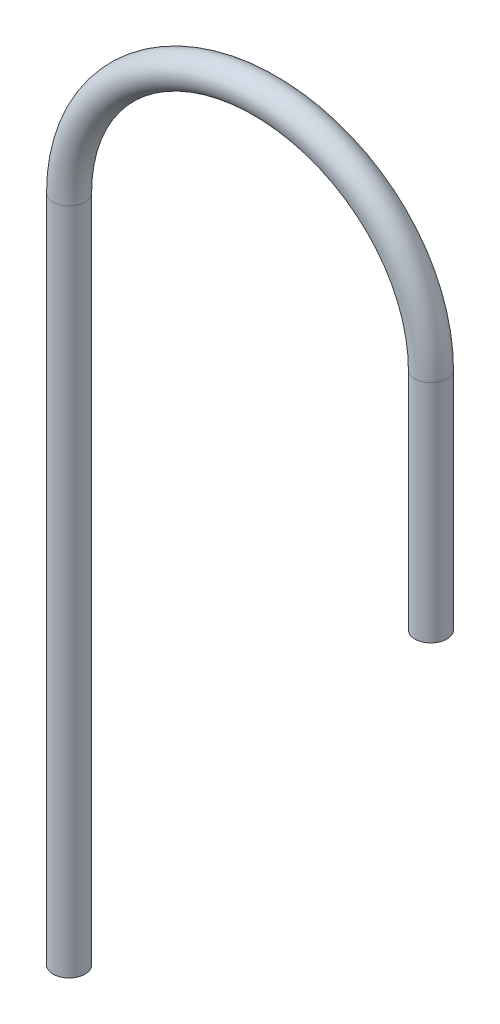
ISO-10303-21;
HEADER;
FILE_DESCRIPTION(('STEP AP214'),'2;1');
FILE_NAME('part.step','',(''),(''),'','','');
FILE_SCHEMA(('AUTOMOTIVE_DESIGN { 1 0 10303 214 1 1 1 1 }'));
ENDSEC;
DATA;
#1=APPLICATION_CONTEXT('core data for automotive mechanical design processes');
#2=APPLICATION_PROTOCOL_DEFINITION('international standard','automotive_design',2000,#1);
#3=PRODUCT_CONTEXT('',#1,'mechanical');
#4=PRODUCT('Part','Part','',(#3));
#5=PRODUCT_RELATED_PRODUCT_CATEGORY('part','',(#4));
#6=PRODUCT_DEFINITION_FORMATION('','',#4);
#7=PRODUCT_DEFINITION_CONTEXT('part definition',#1,'design');
#8=PRODUCT_DEFINITION('design','',#6,#7);
#9=PRODUCT_DEFINITION_SHAPE('','',#8);
#10=(LENGTH_UNIT() NAMED_UNIT(*) SI_UNIT(.MILLI.,.METRE.));
#11=(NAMED_UNIT(*) PLANE_ANGLE_UNIT() SI_UNIT($,.RADIAN.));
#12=(NAMED_UNIT(*) SI_UNIT($,.STERADIAN.) SOLID_ANGLE_UNIT());
#13=UNCERTAINTY_MEASURE_WITH_UNIT(LENGTH_MEASURE(1.E-05),#10,'distance_accuracy_value','');
#14=(GEOMETRIC_REPRESENTATION_CONTEXT(3) GLOBAL_UNCERTAINTY_ASSIGNED_CONTEXT((#13)) GLOBAL_UNIT_ASSIGNED_CONTEXT((#10,
#11,#12)) REPRESENTATION_CONTEXT('',''));
#15=CARTESIAN_POINT('',(0.,0.,0.));
#16=DIRECTION('',(0.,0.,1.));
#17=DIRECTION('',(1.,0.,0.));
#18=AXIS2_PLACEMENT_3D('',#15,#16,#17);
#19=CARTESIAN_POINT('',(-14.,165.,-59.25));
#20=DIRECTION('',(0.,-1.,0.));
#21=DIRECTION('',(0.165120370379971,0.,0.986273422173376));
#22=AXIS2_PLACEMENT_3D('',#19,#20,#21);
#23=PLANE('',#22);
#24=CARTESIAN_POINT('',(-14.,165.,-59.25));
#25=DIRECTION('',(0.,-1.,0.));
#26=DIRECTION('',(0.,0.,-1.));
#27=AXIS2_PLACEMENT_3D('',#24,#25,#26);
#28=CIRCLE('',#27,2.);
#29=CARTESIAN_POINT('',(-14.,165.,-61.25));
#30=VERTEX_POINT('',#29);
#31=EDGE_CURVE('E66',#30,#30,#28,.T.);
#32=ORIENTED_EDGE('',*,*,#31,.F.);
#33=EDGE_LOOP('',(#32));
#34=FACE_BOUND('',#33,.T.);
#35=CARTESIAN_POINT('',(-14.,165.,-59.25));
#36=DIRECTION('',(0.,-1.,0.));
#37=DIRECTION('',(0.165120370379971,0.,0.986273422173376));
#38=AXIS2_PLACEMENT_3D('',#35,#36,#37);
#39=CIRCLE('',#38,3.);
#40=CARTESIAN_POINT('',(-13.5046388888601,165.,-56.2911797334799));
#41=VERTEX_POINT('',#40);
#42=EDGE_CURVE('E57',#41,#41,#39,.T.);
#43=ORIENTED_EDGE('',*,*,#42,.T.);
#44=EDGE_LOOP('',(#43));
#45=FACE_BOUND('',#44,.T.);
#46=ADVANCED_FACE('F43',(#34,#45),#23,.T.);
#47=CARTESIAN_POINT('',(-76.8149247014594,81.6500000000002,-54.0281491126504));
#48=DIRECTION('',(0.,1.,0.));
#49=DIRECTION('',(0.,0.,1.));
#50=AXIS2_PLACEMENT_3D('',#47,#48,#49);
#51=PLANE('',#50);
#52=CARTESIAN_POINT('',(-76.8149247014594,81.6500000000002,-54.0281491126504));
#53=DIRECTION('',(0.,1.,0.));
#54=DIRECTION('',(0.,0.,1.));
#55=AXIS2_PLACEMENT_3D('',#52,#53,#54);
#56=CIRCLE('',#55,2.);
#57=CARTESIAN_POINT('',(-76.8149247014594,81.6500000000002,-52.0281491126504));
#58=VERTEX_POINT('',#57);
#59=EDGE_CURVE('E62',#58,#58,#56,.T.);
#60=ORIENTED_EDGE('',*,*,#59,.T.);
#61=EDGE_LOOP('',(#60));
#62=FACE_BOUND('',#61,.T.);
#63=CARTESIAN_POINT('',(-76.8149247014594,81.6500000000002,-54.0281491126504));
#64=DIRECTION('',(0.,1.,0.));
#65=DIRECTION('',(0.,0.,1.));
#66=AXIS2_PLACEMENT_3D('',#63,#64,#65);
#67=CIRCLE('',#66,3.);
#68=CARTESIAN_POINT('',(-76.8149247014594,81.6500000000002,-51.0281491126504));
#69=VERTEX_POINT('',#68);
#70=EDGE_CURVE('E11',#69,#69,#67,.T.);
#71=ORIENTED_EDGE('',*,*,#70,.F.);
#72=EDGE_LOOP('',(#71));
#73=FACE_BOUND('',#72,.T.);
#74=ADVANCED_FACE('F86',(#62,#73),#51,.F.);
#75=CARTESIAN_POINT('',(-14.,165.,-59.25));
#76=DIRECTION('',(0.,1.,0.));
#77=DIRECTION('',(0.,0.,1.));
#78=AXIS2_PLACEMENT_3D('',#75,#76,#77);
#79=CYLINDRICAL_SURFACE('',#78,3.);
#80=CARTESIAN_POINT('',(-14.,207.375,-59.25));
#81=DIRECTION('',(0.,-1.,0.));
#82=DIRECTION('',(0.165120370379971,0.,0.986273422173376));
#83=AXIS2_PLACEMENT_3D('',#80,#81,#82);
#84=CIRCLE('',#83,3.);
#85=CARTESIAN_POINT('',(-11.0103126585243,207.375,-59.4985349074472));
#86=VERTEX_POINT('',#85);
#87=EDGE_CURVE('E53',#86,#86,#84,.T.);
#88=ORIENTED_EDGE('',*,*,#87,.T.);
#89=EDGE_LOOP('',(#88));
#90=FACE_BOUND('',#89,.T.);
#91=ORIENTED_EDGE('',*,*,#42,.F.);
#92=EDGE_LOOP('',(#91));
#93=FACE_BOUND('',#92,.T.);
#94=ADVANCED_FACE('F90',(#90,#93),#79,.T.);
#95=CARTESIAN_POINT('',(-45.4074623507297,207.375,-56.6390745563252));
#96=DIRECTION('',(0.0828449691490815,0.,0.996562447158575));
#97=DIRECTION('',(0.996562447158575,0.,-0.0828449691490815));
#98=AXIS2_PLACEMENT_3D('',#95,#96,#97);
#99=TOROIDAL_SURFACE('',#98,31.5157995771158,3.);
#100=CARTESIAN_POINT('',(-76.8149247014594,207.375,-54.0281491126504));
#101=DIRECTION('',(0.,1.,0.));
#102=DIRECTION('',(0.,0.,1.));
#103=AXIS2_PLACEMENT_3D('',#100,#101,#102);
#104=CIRCLE('',#103,3.);
#105=CARTESIAN_POINT('',(-79.8046120429351,207.375,-53.7796142052032));
#106=VERTEX_POINT('',#105);
#107=EDGE_CURVE('E49',#106,#106,#104,.T.);
#108=CARTESIAN_POINT('',(-45.4074623507297,207.375,-56.6390745563252));
#109=DIRECTION('',(0.0828449691490815,0.,0.996562447158575));
#110=DIRECTION('',(0.996562447158575,0.,-0.0828449691490815));
#111=AXIS2_PLACEMENT_3D('',#108,#109,#110);
#112=CIRCLE('',#111,34.5157995771158);
#113=EDGE_CURVE('',#86,#106,#112,.T.);
#114=ORIENTED_EDGE('',*,*,#87,.F.);
#115=ORIENTED_EDGE('',*,*,#107,.T.);
#116=ORIENTED_EDGE('',*,*,#113,.T.);
#117=ORIENTED_EDGE('',*,*,#113,.F.);
#118=EDGE_LOOP('',(#114,#116,#115,#117));
#119=FACE_BOUND('',#118,.T.);
#120=ADVANCED_FACE('F92',(#119),#99,.T.);
#121=CARTESIAN_POINT('',(-76.8149247014594,207.375,-54.0281491126504));
#122=DIRECTION('',(0.,-1.,0.));
#123=DIRECTION('',(0.,0.,-1.));
#124=AXIS2_PLACEMENT_3D('',#121,#122,#123);
#125=CYLINDRICAL_SURFACE('',#124,3.);
#126=ORIENTED_EDGE('',*,*,#70,.T.);
#127=EDGE_LOOP('',(#126));
#128=FACE_BOUND('',#127,.T.);
#129=ORIENTED_EDGE('',*,*,#107,.F.);
#130=EDGE_LOOP('',(#129));
#131=FACE_BOUND('',#130,.T.);
#132=ADVANCED_FACE('F80',(#128,#131),#125,.T.);
#133=CARTESIAN_POINT('',(-14.,165.,-59.25));
#134=DIRECTION('',(0.,1.,0.));
#135=DIRECTION('',(0.,0.,1.));
#136=AXIS2_PLACEMENT_3D('',#133,#134,#135);
#137=CYLINDRICAL_SURFACE('',#136,2.);
#138=CARTESIAN_POINT('',(-14.,207.375,-59.25));
#139=DIRECTION('',(0.,1.,0.));
#140=DIRECTION('',(0.,0.,1.));
#141=AXIS2_PLACEMENT_3D('',#138,#139,#140);
#142=CIRCLE('',#141,2.);
#143=CARTESIAN_POINT('',(-12.0068751056829,207.375,-59.4156899382982));
#144=VERTEX_POINT('',#143);
#145=EDGE_CURVE('E69',#144,#144,#142,.F.);
#146=ORIENTED_EDGE('',*,*,#145,.F.);
#147=EDGE_LOOP('',(#146));
#148=FACE_BOUND('',#147,.T.);
#149=ORIENTED_EDGE('',*,*,#31,.T.);
#150=EDGE_LOOP('',(#149));
#151=FACE_BOUND('',#150,.T.);
#152=ADVANCED_FACE('F77',(#148,#151),#137,.F.);
#153=CARTESIAN_POINT('',(-45.4074623507297,207.375,-56.6390745563252));
#154=DIRECTION('',(0.0828449691490815,0.,0.996562447158575));
#155=DIRECTION('',(0.996562447158575,0.,-0.0828449691490815));
#156=AXIS2_PLACEMENT_3D('',#153,#154,#155);
#157=TOROIDAL_SURFACE('',#156,31.5157995771158,2.);
#158=CARTESIAN_POINT('',(-76.8149247014594,207.375,-54.0281491126504));
#159=DIRECTION('',(0.,1.,0.));
#160=DIRECTION('',(-1.,0.,0.));
#161=AXIS2_PLACEMENT_3D('',#158,#159,#160);
#162=CIRCLE('',#161,2.);
#163=CARTESIAN_POINT('',(-78.8080495957765,207.375,-53.8624591743522));
#164=VERTEX_POINT('',#163);
#165=EDGE_CURVE('E65',#164,#164,#162,.T.);
#166=CARTESIAN_POINT('',(-45.4074623507297,207.375,-56.6390745563252));
#167=DIRECTION('',(0.0828449691490815,0.,0.996562447158575));
#168=DIRECTION('',(0.996562447158575,0.,-0.0828449691490815));
#169=AXIS2_PLACEMENT_3D('',#166,#167,#168);
#170=CIRCLE('',#169,33.5157995771158);
#171=EDGE_CURVE('',#144,#164,#170,.T.);
#172=ORIENTED_EDGE('',*,*,#145,.T.);
#173=ORIENTED_EDGE('',*,*,#165,.F.);
#174=ORIENTED_EDGE('',*,*,#171,.T.);
#175=ORIENTED_EDGE('',*,*,#171,.F.);
#176=EDGE_LOOP('',(#172,#174,#173,#175));
#177=FACE_BOUND('',#176,.T.);
#178=ADVANCED_FACE('F75',(#177),#157,.F.);
#179=CARTESIAN_POINT('',(-76.8149247014594,207.375,-54.0281491126504));
#180=DIRECTION('',(0.,-1.,0.));
#181=DIRECTION('',(0.,0.,-1.));
#182=AXIS2_PLACEMENT_3D('',#179,#180,#181);
#183=CYLINDRICAL_SURFACE('',#182,2.);
#184=ORIENTED_EDGE('',*,*,#59,.F.);
#185=EDGE_LOOP('',(#184));
#186=FACE_BOUND('',#185,.T.);
#187=ORIENTED_EDGE('',*,*,#165,.T.);
#188=EDGE_LOOP('',(#187));
#189=FACE_BOUND('',#188,.T.);
#190=ADVANCED_FACE('F87',(#186,#189),#183,.F.);
#191=CLOSED_SHELL('',(#46,#74,#94,#120,#132,#152,#178,#190));
#192=MANIFOLD_SOLID_BREP('B2',#191);
#193=ADVANCED_BREP_SHAPE_REPRESENTATION('',(#18,#192),#14);
#194=SHAPE_DEFINITION_REPRESENTATION(#9,#193);
ENDSEC;
END-ISO-10303-21;
